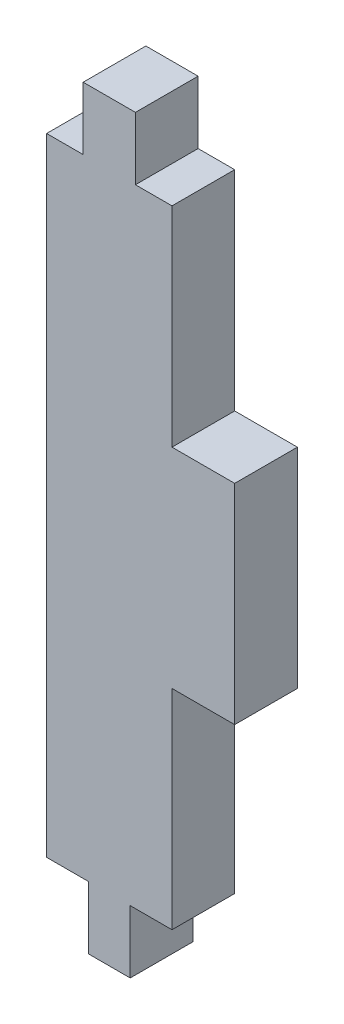
ISO-10303-21;
HEADER;
FILE_DESCRIPTION(('STEP AP214'),'2;1');
FILE_NAME('part.step','',(''),(''),'','','');
FILE_SCHEMA(('AUTOMOTIVE_DESIGN { 1 0 10303 214 1 1 1 1 }'));
ENDSEC;
DATA;
#1=APPLICATION_CONTEXT('core data for automotive mechanical design processes');
#2=APPLICATION_PROTOCOL_DEFINITION('international standard','automotive_design',2000,#1);
#3=PRODUCT_CONTEXT('',#1,'mechanical');
#4=PRODUCT('Part','Part','',(#3));
#5=PRODUCT_RELATED_PRODUCT_CATEGORY('part','',(#4));
#6=PRODUCT_DEFINITION_FORMATION('','',#4);
#7=PRODUCT_DEFINITION_CONTEXT('part definition',#1,'design');
#8=PRODUCT_DEFINITION('design','',#6,#7);
#9=PRODUCT_DEFINITION_SHAPE('','',#8);
#10=(LENGTH_UNIT() NAMED_UNIT(*) SI_UNIT(.MILLI.,.METRE.));
#11=(NAMED_UNIT(*) PLANE_ANGLE_UNIT() SI_UNIT($,.RADIAN.));
#12=(NAMED_UNIT(*) SI_UNIT($,.STERADIAN.) SOLID_ANGLE_UNIT());
#13=UNCERTAINTY_MEASURE_WITH_UNIT(LENGTH_MEASURE(1.E-05),#10,'distance_accuracy_value','');
#14=(GEOMETRIC_REPRESENTATION_CONTEXT(3) GLOBAL_UNCERTAINTY_ASSIGNED_CONTEXT((#13)) GLOBAL_UNIT_ASSIGNED_CONTEXT((#10,
#11,#12)) REPRESENTATION_CONTEXT('',''));
#15=CARTESIAN_POINT('',(0.,0.,0.));
#16=DIRECTION('',(0.,0.,1.));
#17=DIRECTION('',(1.,0.,0.));
#18=AXIS2_PLACEMENT_3D('',#15,#16,#17);
#19=CARTESIAN_POINT('',(-37.2306097479879,-66.1800034107966,0.));
#20=DIRECTION('',(0.,0.,1.));
#21=DIRECTION('',(1.,0.,0.));
#22=AXIS2_PLACEMENT_3D('',#19,#20,#21);
#23=PLANE('',#22);
#24=DIRECTION('',(1.,0.,0.));
#25=VECTOR('',#24,1.);
#26=CARTESIAN_POINT('',(-37.2306097479879,-66.1800034107966,0.));
#27=LINE('',#26,#25);
#28=CARTESIAN_POINT('',(-30.5639430813212,-66.1800034107966,0.));
#29=VERTEX_POINT('',#28);
#30=CARTESIAN_POINT('',(-27.2306097479879,-66.1800034107966,0.));
#31=VERTEX_POINT('',#30);
#32=EDGE_CURVE('E225',#29,#31,#27,.T.);
#33=ORIENTED_EDGE('',*,*,#32,.F.);
#34=DIRECTION('',(0.,-1.,0.));
#35=VECTOR('',#34,1.);
#36=CARTESIAN_POINT('',(-30.5639430813212,-61.1800034107967,0.));
#37=LINE('',#36,#35);
#38=CARTESIAN_POINT('',(-30.5639430813212,-71.1800034107967,0.));
#39=VERTEX_POINT('',#38);
#40=EDGE_CURVE('E307',#29,#39,#37,.T.);
#41=ORIENTED_EDGE('',*,*,#40,.T.);
#42=DIRECTION('',(1.,0.,0.));
#43=VECTOR('',#42,1.);
#44=CARTESIAN_POINT('',(-33.8972764146545,-71.1800034107967,0.));
#45=LINE('',#44,#43);
#46=CARTESIAN_POINT('',(-33.8972764146545,-71.1800034107967,0.));
#47=VERTEX_POINT('',#46);
#48=EDGE_CURVE('E309',#47,#39,#45,.T.);
#49=ORIENTED_EDGE('',*,*,#48,.F.);
#50=DIRECTION('',(0.,-1.,0.));
#51=VECTOR('',#50,1.);
#52=CARTESIAN_POINT('',(-33.8972764146545,-61.1800034107967,0.));
#53=LINE('',#52,#51);
#54=CARTESIAN_POINT('',(-33.8972764146545,-66.1800034107966,0.));
#55=VERTEX_POINT('',#54);
#56=EDGE_CURVE('E302',#55,#47,#53,.T.);
#57=ORIENTED_EDGE('',*,*,#56,.F.);
#58=CARTESIAN_POINT('',(-37.2306097479879,-66.1800034107966,0.));
#59=VERTEX_POINT('',#58);
#60=EDGE_CURVE('E220',#59,#55,#27,.T.);
#61=ORIENTED_EDGE('',*,*,#60,.F.);
#62=DIRECTION('',(0.,-1.,0.));
#63=VECTOR('',#62,1.);
#64=CARTESIAN_POINT('',(-37.2306097479879,-16.1800034107966,0.));
#65=LINE('',#64,#63);
#66=CARTESIAN_POINT('',(-37.2306097479879,-16.1800034107966,0.));
#67=VERTEX_POINT('',#66);
#68=EDGE_CURVE('E297',#67,#59,#65,.T.);
#69=ORIENTED_EDGE('',*,*,#68,.F.);
#70=DIRECTION('',(1.,0.,0.));
#71=VECTOR('',#70,1.);
#72=CARTESIAN_POINT('',(-37.2306097479879,-16.1800034107966,0.));
#73=LINE('',#72,#71);
#74=CARTESIAN_POINT('',(-34.3139430813212,-16.1800034107966,0.));
#75=VERTEX_POINT('',#74);
#76=EDGE_CURVE('E236',#67,#75,#73,.T.);
#77=ORIENTED_EDGE('',*,*,#76,.T.);
#78=DIRECTION('',(0.,-1.,0.));
#79=VECTOR('',#78,1.);
#80=CARTESIAN_POINT('',(-34.3139430813212,-11.1800034107966,0.));
#81=LINE('',#80,#79);
#82=CARTESIAN_POINT('',(-34.3139430813212,-11.1800034107966,0.));
#83=VERTEX_POINT('',#82);
#84=EDGE_CURVE('E281',#83,#75,#81,.T.);
#85=ORIENTED_EDGE('',*,*,#84,.F.);
#86=DIRECTION('',(1.,0.,0.));
#87=VECTOR('',#86,1.);
#88=CARTESIAN_POINT('',(-34.3139430813212,-11.1800034107966,0.));
#89=LINE('',#88,#87);
#90=CARTESIAN_POINT('',(-30.1472764146545,-11.1800034107966,0.));
#91=VERTEX_POINT('',#90);
#92=EDGE_CURVE('E287',#83,#91,#89,.T.);
#93=ORIENTED_EDGE('',*,*,#92,.T.);
#94=DIRECTION('',(0.,-1.,0.));
#95=VECTOR('',#94,1.);
#96=CARTESIAN_POINT('',(-30.1472764146545,-11.1800034107966,0.));
#97=LINE('',#96,#95);
#98=CARTESIAN_POINT('',(-30.1472764146545,-16.1800034107966,0.));
#99=VERTEX_POINT('',#98);
#100=EDGE_CURVE('E290',#91,#99,#97,.T.);
#101=ORIENTED_EDGE('',*,*,#100,.T.);
#102=CARTESIAN_POINT('',(-27.2306097479879,-16.1800034107966,0.));
#103=VERTEX_POINT('',#102);
#104=EDGE_CURVE('E222',#99,#103,#73,.T.);
#105=ORIENTED_EDGE('',*,*,#104,.T.);
#106=DIRECTION('',(0.,-1.,0.));
#107=VECTOR('',#106,1.);
#108=CARTESIAN_POINT('',(-27.2306097479879,-16.1800034107966,0.));
#109=LINE('',#108,#107);
#110=CARTESIAN_POINT('',(-27.2306097479879,-32.8466700774633,0.));
#111=VERTEX_POINT('',#110);
#112=EDGE_CURVE('E191',#103,#111,#109,.T.);
#113=ORIENTED_EDGE('',*,*,#112,.T.);
#114=DIRECTION('',(1.,0.,0.));
#115=VECTOR('',#114,1.);
#116=CARTESIAN_POINT('',(-27.2306097479879,-32.8466700774633,0.));
#117=LINE('',#116,#115);
#118=CARTESIAN_POINT('',(-22.2306097479879,-32.8466700774633,0.));
#119=VERTEX_POINT('',#118);
#120=EDGE_CURVE('E176',#111,#119,#117,.T.);
#121=ORIENTED_EDGE('',*,*,#120,.T.);
#122=DIRECTION('',(0.,1.,0.));
#123=VECTOR('',#122,1.);
#124=CARTESIAN_POINT('',(-22.2306097479879,-49.51333674413,0.));
#125=LINE('',#124,#123);
#126=CARTESIAN_POINT('',(-22.2306097479879,-49.51333674413,0.));
#127=VERTEX_POINT('',#126);
#128=EDGE_CURVE('E165',#127,#119,#125,.T.);
#129=ORIENTED_EDGE('',*,*,#128,.F.);
#130=DIRECTION('',(1.,0.,0.));
#131=VECTOR('',#130,1.);
#132=CARTESIAN_POINT('',(-27.2306097479879,-49.51333674413,0.));
#133=LINE('',#132,#131);
#134=CARTESIAN_POINT('',(-27.2306097479879,-49.51333674413,0.));
#135=VERTEX_POINT('',#134);
#136=EDGE_CURVE('E186',#135,#127,#133,.T.);
#137=ORIENTED_EDGE('',*,*,#136,.F.);
#138=EDGE_CURVE('E211',#135,#31,#109,.T.);
#139=ORIENTED_EDGE('',*,*,#138,.T.);
#140=EDGE_LOOP('',(#33,#41,#49,#57,#61,#69,#77,#85,#93,#101,#105,#113,#121,#129,#137,#139));
#141=FACE_BOUND('',#140,.T.);
#142=ADVANCED_FACE('F103',(#141),#23,.F.);
#143=CARTESIAN_POINT('',(-37.2306097479879,-66.1800034107966,5.));
#144=DIRECTION('',(0.,0.,1.));
#145=DIRECTION('',(1.,0.,0.));
#146=AXIS2_PLACEMENT_3D('',#143,#144,#145);
#147=PLANE('',#146);
#148=DIRECTION('',(1.,0.,0.));
#149=VECTOR('',#148,1.);
#150=CARTESIAN_POINT('',(-37.2306097479879,-66.1800034107966,5.));
#151=LINE('',#150,#149);
#152=CARTESIAN_POINT('',(-37.2306097479879,-66.1800034107966,5.));
#153=VERTEX_POINT('',#152);
#154=CARTESIAN_POINT('',(-33.8972764146545,-66.1800034107966,5.));
#155=VERTEX_POINT('',#154);
#156=EDGE_CURVE('E340',#153,#155,#151,.T.);
#157=ORIENTED_EDGE('',*,*,#156,.T.);
#158=DIRECTION('',(0.,-1.,0.));
#159=VECTOR('',#158,1.);
#160=CARTESIAN_POINT('',(-33.8972764146545,-61.1800034107967,5.));
#161=LINE('',#160,#159);
#162=CARTESIAN_POINT('',(-33.8972764146545,-71.1800034107967,5.));
#163=VERTEX_POINT('',#162);
#164=EDGE_CURVE('E305',#155,#163,#161,.T.);
#165=ORIENTED_EDGE('',*,*,#164,.T.);
#166=DIRECTION('',(1.,0.,0.));
#167=VECTOR('',#166,1.);
#168=CARTESIAN_POINT('',(-33.8972764146545,-71.1800034107967,5.));
#169=LINE('',#168,#167);
#170=CARTESIAN_POINT('',(-30.5639430813212,-71.1800034107967,5.));
#171=VERTEX_POINT('',#170);
#172=EDGE_CURVE('E301',#163,#171,#169,.T.);
#173=ORIENTED_EDGE('',*,*,#172,.T.);
#174=DIRECTION('',(0.,-1.,0.));
#175=VECTOR('',#174,1.);
#176=CARTESIAN_POINT('',(-30.5639430813212,-61.1800034107967,5.));
#177=LINE('',#176,#175);
#178=CARTESIAN_POINT('',(-30.5639430813212,-66.1800034107966,5.));
#179=VERTEX_POINT('',#178);
#180=EDGE_CURVE('E299',#179,#171,#177,.T.);
#181=ORIENTED_EDGE('',*,*,#180,.F.);
#182=CARTESIAN_POINT('',(-27.2306097479879,-66.1800034107966,5.));
#183=VERTEX_POINT('',#182);
#184=EDGE_CURVE('E349',#179,#183,#151,.T.);
#185=ORIENTED_EDGE('',*,*,#184,.T.);
#186=DIRECTION('',(0.,-1.,0.));
#187=VECTOR('',#186,1.);
#188=CARTESIAN_POINT('',(-27.2306097479879,-16.1800034107966,5.));
#189=LINE('',#188,#187);
#190=CARTESIAN_POINT('',(-27.2306097479879,-49.51333674413,5.));
#191=VERTEX_POINT('',#190);
#192=EDGE_CURVE('E343',#191,#183,#189,.T.);
#193=ORIENTED_EDGE('',*,*,#192,.F.);
#194=DIRECTION('',(1.,0.,0.));
#195=VECTOR('',#194,1.);
#196=CARTESIAN_POINT('',(-27.2306097479879,-49.51333674413,5.));
#197=LINE('',#196,#195);
#198=CARTESIAN_POINT('',(-22.2306097479879,-49.51333674413,5.));
#199=VERTEX_POINT('',#198);
#200=EDGE_CURVE('E192',#191,#199,#197,.T.);
#201=ORIENTED_EDGE('',*,*,#200,.T.);
#202=DIRECTION('',(0.,1.,0.));
#203=VECTOR('',#202,1.);
#204=CARTESIAN_POINT('',(-22.2306097479879,-49.51333674413,5.));
#205=LINE('',#204,#203);
#206=CARTESIAN_POINT('',(-22.2306097479879,-32.8466700774633,5.));
#207=VERTEX_POINT('',#206);
#208=EDGE_CURVE('E195',#199,#207,#205,.T.);
#209=ORIENTED_EDGE('',*,*,#208,.T.);
#210=DIRECTION('',(1.,0.,0.));
#211=VECTOR('',#210,1.);
#212=CARTESIAN_POINT('',(-27.2306097479879,-32.8466700774633,5.));
#213=LINE('',#212,#211);
#214=CARTESIAN_POINT('',(-27.2306097479879,-32.8466700774633,5.));
#215=VERTEX_POINT('',#214);
#216=EDGE_CURVE('E179',#215,#207,#213,.T.);
#217=ORIENTED_EDGE('',*,*,#216,.F.);
#218=CARTESIAN_POINT('',(-27.2306097479879,-16.1800034107966,5.));
#219=VERTEX_POINT('',#218);
#220=EDGE_CURVE('E230',#219,#215,#189,.T.);
#221=ORIENTED_EDGE('',*,*,#220,.F.);
#222=DIRECTION('',(1.,0.,0.));
#223=VECTOR('',#222,1.);
#224=CARTESIAN_POINT('',(-37.2306097479879,-16.1800034107966,5.));
#225=LINE('',#224,#223);
#226=CARTESIAN_POINT('',(-30.1472764146545,-16.1800034107966,5.));
#227=VERTEX_POINT('',#226);
#228=EDGE_CURVE('E337',#227,#219,#225,.T.);
#229=ORIENTED_EDGE('',*,*,#228,.F.);
#230=DIRECTION('',(0.,-1.,0.));
#231=VECTOR('',#230,1.);
#232=CARTESIAN_POINT('',(-30.1472764146545,-11.1800034107966,5.));
#233=LINE('',#232,#231);
#234=CARTESIAN_POINT('',(-30.1472764146545,-11.1800034107966,5.));
#235=VERTEX_POINT('',#234);
#236=EDGE_CURVE('E280',#235,#227,#233,.T.);
#237=ORIENTED_EDGE('',*,*,#236,.F.);
#238=DIRECTION('',(1.,0.,0.));
#239=VECTOR('',#238,1.);
#240=CARTESIAN_POINT('',(-34.3139430813212,-11.1800034107966,5.));
#241=LINE('',#240,#239);
#242=CARTESIAN_POINT('',(-34.3139430813212,-11.1800034107966,5.));
#243=VERTEX_POINT('',#242);
#244=EDGE_CURVE('E277',#243,#235,#241,.T.);
#245=ORIENTED_EDGE('',*,*,#244,.F.);
#246=DIRECTION('',(0.,-1.,0.));
#247=VECTOR('',#246,1.);
#248=CARTESIAN_POINT('',(-34.3139430813212,-11.1800034107966,5.));
#249=LINE('',#248,#247);
#250=CARTESIAN_POINT('',(-34.3139430813212,-16.1800034107966,5.));
#251=VERTEX_POINT('',#250);
#252=EDGE_CURVE('E283',#243,#251,#249,.T.);
#253=ORIENTED_EDGE('',*,*,#252,.T.);
#254=CARTESIAN_POINT('',(-37.2306097479879,-16.1800034107966,5.));
#255=VERTEX_POINT('',#254);
#256=EDGE_CURVE('E245',#255,#251,#225,.T.);
#257=ORIENTED_EDGE('',*,*,#256,.F.);
#258=DIRECTION('',(0.,-1.,0.));
#259=VECTOR('',#258,1.);
#260=CARTESIAN_POINT('',(-37.2306097479879,-16.1800034107966,5.));
#261=LINE('',#260,#259);
#262=EDGE_CURVE('E240',#255,#153,#261,.T.);
#263=ORIENTED_EDGE('',*,*,#262,.T.);
#264=EDGE_LOOP('',(#157,#165,#173,#181,#185,#193,#201,#209,#217,#221,#229,#237,#245,#253,#257,#263));
#265=FACE_BOUND('',#264,.T.);
#266=ADVANCED_FACE('F355',(#265),#147,.T.);
#267=CARTESIAN_POINT('',(-37.2306097479879,-16.1800034107966,5.));
#268=DIRECTION('',(0.,1.,0.));
#269=DIRECTION('',(0.,0.,1.));
#270=AXIS2_PLACEMENT_3D('',#267,#268,#269);
#271=PLANE('',#270);
#272=ORIENTED_EDGE('',*,*,#256,.T.);
#273=DIRECTION('',(0.,0.,-1.));
#274=VECTOR('',#273,1.);
#275=CARTESIAN_POINT('',(-34.3139430813212,-16.1800034107966,5.));
#276=LINE('',#275,#274);
#277=EDGE_CURVE('E254',#251,#75,#276,.T.);
#278=ORIENTED_EDGE('',*,*,#277,.T.);
#279=ORIENTED_EDGE('',*,*,#76,.F.);
#280=DIRECTION('',(0.,0.,-1.));
#281=VECTOR('',#280,1.);
#282=CARTESIAN_POINT('',(-37.2306097479879,-16.1800034107966,5.));
#283=LINE('',#282,#281);
#284=EDGE_CURVE('E241',#255,#67,#283,.T.);
#285=ORIENTED_EDGE('',*,*,#284,.F.);
#286=EDGE_LOOP('',(#272,#278,#279,#285));
#287=FACE_BOUND('',#286,.T.);
#288=ADVANCED_FACE('F362',(#287),#271,.T.);
#289=CARTESIAN_POINT('',(-37.2306097479879,-16.1800034107966,5.));
#290=DIRECTION('',(1.,0.,0.));
#291=DIRECTION('',(0.,1.,0.));
#292=AXIS2_PLACEMENT_3D('',#289,#290,#291);
#293=PLANE('',#292);
#294=ORIENTED_EDGE('',*,*,#68,.T.);
#295=DIRECTION('',(0.,0.,-1.));
#296=VECTOR('',#295,1.);
#297=CARTESIAN_POINT('',(-37.2306097479879,-66.1800034107966,5.));
#298=LINE('',#297,#296);
#299=EDGE_CURVE('E248',#153,#59,#298,.T.);
#300=ORIENTED_EDGE('',*,*,#299,.F.);
#301=ORIENTED_EDGE('',*,*,#262,.F.);
#302=ORIENTED_EDGE('',*,*,#284,.T.);
#303=EDGE_LOOP('',(#294,#300,#301,#302));
#304=FACE_BOUND('',#303,.T.);
#305=ADVANCED_FACE('F359',(#304),#293,.F.);
#306=CARTESIAN_POINT('',(-37.2306097479879,-66.1800034107966,5.));
#307=DIRECTION('',(0.,1.,0.));
#308=DIRECTION('',(0.,0.,1.));
#309=AXIS2_PLACEMENT_3D('',#306,#307,#308);
#310=PLANE('',#309);
#311=DIRECTION('',(0.,0.,-1.));
#312=VECTOR('',#311,1.);
#313=CARTESIAN_POINT('',(-33.8972764146545,-66.1800034107966,5.));
#314=LINE('',#313,#312);
#315=EDGE_CURVE('E264',#155,#55,#314,.T.);
#316=ORIENTED_EDGE('',*,*,#315,.F.);
#317=ORIENTED_EDGE('',*,*,#156,.F.);
#318=ORIENTED_EDGE('',*,*,#299,.T.);
#319=ORIENTED_EDGE('',*,*,#60,.T.);
#320=EDGE_LOOP('',(#316,#317,#318,#319));
#321=FACE_BOUND('',#320,.T.);
#322=ADVANCED_FACE('F361',(#321),#310,.F.);
#323=ORIENTED_EDGE('',*,*,#184,.F.);
#324=DIRECTION('',(0.,0.,-1.));
#325=VECTOR('',#324,1.);
#326=CARTESIAN_POINT('',(-30.5639430813212,-66.1800034107966,5.));
#327=LINE('',#326,#325);
#328=EDGE_CURVE('E261',#179,#29,#327,.T.);
#329=ORIENTED_EDGE('',*,*,#328,.T.);
#330=ORIENTED_EDGE('',*,*,#32,.T.);
#331=DIRECTION('',(0.,0.,-1.));
#332=VECTOR('',#331,1.);
#333=CARTESIAN_POINT('',(-27.2306097479879,-66.1800034107966,5.));
#334=LINE('',#333,#332);
#335=EDGE_CURVE('E219',#183,#31,#334,.T.);
#336=ORIENTED_EDGE('',*,*,#335,.F.);
#337=EDGE_LOOP('',(#323,#329,#330,#336));
#338=FACE_BOUND('',#337,.T.);
#339=ADVANCED_FACE('F368',(#338),#310,.F.);
#340=CARTESIAN_POINT('',(-27.2306097479879,-16.1800034107966,5.));
#341=DIRECTION('',(1.,0.,0.));
#342=DIRECTION('',(0.,1.,0.));
#343=AXIS2_PLACEMENT_3D('',#340,#341,#342);
#344=PLANE('',#343);
#345=DIRECTION('',(0.,0.,-1.));
#346=VECTOR('',#345,1.);
#347=CARTESIAN_POINT('',(-27.2306097479879,-49.51333674413,5.));
#348=LINE('',#347,#346);
#349=EDGE_CURVE('E12',#191,#135,#348,.T.);
#350=ORIENTED_EDGE('',*,*,#349,.F.);
#351=ORIENTED_EDGE('',*,*,#192,.T.);
#352=ORIENTED_EDGE('',*,*,#335,.T.);
#353=ORIENTED_EDGE('',*,*,#138,.F.);
#354=EDGE_LOOP('',(#350,#351,#352,#353));
#355=FACE_BOUND('',#354,.T.);
#356=ADVANCED_FACE('F216',(#355),#344,.T.);
#357=ORIENTED_EDGE('',*,*,#220,.T.);
#358=DIRECTION('',(0.,0.,-1.));
#359=VECTOR('',#358,1.);
#360=CARTESIAN_POINT('',(-27.2306097479879,-32.8466700774633,5.));
#361=LINE('',#360,#359);
#362=EDGE_CURVE('E113',#215,#111,#361,.T.);
#363=ORIENTED_EDGE('',*,*,#362,.T.);
#364=ORIENTED_EDGE('',*,*,#112,.F.);
#365=DIRECTION('',(0.,0.,-1.));
#366=VECTOR('',#365,1.);
#367=CARTESIAN_POINT('',(-27.2306097479879,-16.1800034107966,5.));
#368=LINE('',#367,#366);
#369=EDGE_CURVE('E244',#219,#103,#368,.T.);
#370=ORIENTED_EDGE('',*,*,#369,.F.);
#371=EDGE_LOOP('',(#357,#363,#364,#370));
#372=FACE_BOUND('',#371,.T.);
#373=ADVANCED_FACE('F408',(#372),#344,.T.);
#374=DIRECTION('',(0.,0.,-1.));
#375=VECTOR('',#374,1.);
#376=CARTESIAN_POINT('',(-30.1472764146545,-16.1800034107966,5.));
#377=LINE('',#376,#375);
#378=EDGE_CURVE('E122',#227,#99,#377,.T.);
#379=ORIENTED_EDGE('',*,*,#378,.F.);
#380=ORIENTED_EDGE('',*,*,#228,.T.);
#381=ORIENTED_EDGE('',*,*,#369,.T.);
#382=ORIENTED_EDGE('',*,*,#104,.F.);
#383=EDGE_LOOP('',(#379,#380,#381,#382));
#384=FACE_BOUND('',#383,.T.);
#385=ADVANCED_FACE('F372',(#384),#271,.T.);
#386=CARTESIAN_POINT('',(-33.8972764146545,-71.1800034107967,5.));
#387=DIRECTION('',(0.,1.,0.));
#388=DIRECTION('',(0.,0.,1.));
#389=AXIS2_PLACEMENT_3D('',#386,#387,#388);
#390=PLANE('',#389);
#391=ORIENTED_EDGE('',*,*,#48,.T.);
#392=DIRECTION('',(0.,0.,-1.));
#393=VECTOR('',#392,1.);
#394=CARTESIAN_POINT('',(-30.5639430813212,-71.1800034107967,5.));
#395=LINE('',#394,#393);
#396=EDGE_CURVE('E269',#171,#39,#395,.T.);
#397=ORIENTED_EDGE('',*,*,#396,.F.);
#398=ORIENTED_EDGE('',*,*,#172,.F.);
#399=DIRECTION('',(0.,0.,-1.));
#400=VECTOR('',#399,1.);
#401=CARTESIAN_POINT('',(-33.8972764146545,-71.1800034107967,5.));
#402=LINE('',#401,#400);
#403=EDGE_CURVE('E291',#163,#47,#402,.T.);
#404=ORIENTED_EDGE('',*,*,#403,.T.);
#405=EDGE_LOOP('',(#391,#397,#398,#404));
#406=FACE_BOUND('',#405,.T.);
#407=ADVANCED_FACE('F325',(#406),#390,.F.);
#408=CARTESIAN_POINT('',(-30.5639430813212,-61.1800034107967,5.));
#409=DIRECTION('',(1.,0.,0.));
#410=DIRECTION('',(0.,0.,-1.));
#411=AXIS2_PLACEMENT_3D('',#408,#409,#410);
#412=PLANE('',#411);
#413=ORIENTED_EDGE('',*,*,#328,.F.);
#414=ORIENTED_EDGE('',*,*,#180,.T.);
#415=ORIENTED_EDGE('',*,*,#396,.T.);
#416=ORIENTED_EDGE('',*,*,#40,.F.);
#417=EDGE_LOOP('',(#413,#414,#415,#416));
#418=FACE_BOUND('',#417,.T.);
#419=ADVANCED_FACE('F322',(#418),#412,.T.);
#420=CARTESIAN_POINT('',(-33.8972764146545,-61.1800034107967,5.));
#421=DIRECTION('',(1.,0.,0.));
#422=DIRECTION('',(0.,0.,-1.));
#423=AXIS2_PLACEMENT_3D('',#420,#421,#422);
#424=PLANE('',#423);
#425=ORIENTED_EDGE('',*,*,#164,.F.);
#426=ORIENTED_EDGE('',*,*,#315,.T.);
#427=ORIENTED_EDGE('',*,*,#56,.T.);
#428=ORIENTED_EDGE('',*,*,#403,.F.);
#429=EDGE_LOOP('',(#425,#426,#427,#428));
#430=FACE_BOUND('',#429,.T.);
#431=ADVANCED_FACE('F386',(#430),#424,.F.);
#432=CARTESIAN_POINT('',(-22.2306097479879,-49.51333674413,5.));
#433=DIRECTION('',(-1.,0.,0.));
#434=DIRECTION('',(0.,0.,1.));
#435=AXIS2_PLACEMENT_3D('',#432,#433,#434);
#436=PLANE('',#435);
#437=ORIENTED_EDGE('',*,*,#128,.T.);
#438=DIRECTION('',(0.,0.,-1.));
#439=VECTOR('',#438,1.);
#440=CARTESIAN_POINT('',(-22.2306097479879,-32.8466700774633,5.));
#441=LINE('',#440,#439);
#442=EDGE_CURVE('E172',#207,#119,#441,.T.);
#443=ORIENTED_EDGE('',*,*,#442,.F.);
#444=ORIENTED_EDGE('',*,*,#208,.F.);
#445=DIRECTION('',(0.,0.,-1.));
#446=VECTOR('',#445,1.);
#447=CARTESIAN_POINT('',(-22.2306097479879,-49.51333674413,5.));
#448=LINE('',#447,#446);
#449=EDGE_CURVE('E181',#199,#127,#448,.T.);
#450=ORIENTED_EDGE('',*,*,#449,.T.);
#451=EDGE_LOOP('',(#437,#443,#444,#450));
#452=FACE_BOUND('',#451,.T.);
#453=ADVANCED_FACE('F183',(#452),#436,.F.);
#454=CARTESIAN_POINT('',(-27.2306097479879,-32.8466700774633,5.));
#455=DIRECTION('',(0.,1.,0.));
#456=DIRECTION('',(0.,0.,1.));
#457=AXIS2_PLACEMENT_3D('',#454,#455,#456);
#458=PLANE('',#457);
#459=ORIENTED_EDGE('',*,*,#120,.F.);
#460=ORIENTED_EDGE('',*,*,#362,.F.);
#461=ORIENTED_EDGE('',*,*,#216,.T.);
#462=ORIENTED_EDGE('',*,*,#442,.T.);
#463=EDGE_LOOP('',(#459,#460,#461,#462));
#464=FACE_BOUND('',#463,.T.);
#465=ADVANCED_FACE('F173',(#464),#458,.T.);
#466=CARTESIAN_POINT('',(-27.2306097479879,-49.51333674413,5.));
#467=DIRECTION('',(0.,1.,0.));
#468=DIRECTION('',(0.,0.,1.));
#469=AXIS2_PLACEMENT_3D('',#466,#467,#468);
#470=PLANE('',#469);
#471=ORIENTED_EDGE('',*,*,#136,.T.);
#472=ORIENTED_EDGE('',*,*,#449,.F.);
#473=ORIENTED_EDGE('',*,*,#200,.F.);
#474=ORIENTED_EDGE('',*,*,#349,.T.);
#475=EDGE_LOOP('',(#471,#472,#473,#474));
#476=FACE_BOUND('',#475,.T.);
#477=ADVANCED_FACE('F105',(#476),#470,.F.);
#478=CARTESIAN_POINT('',(-30.1472764146545,-11.1800034107966,5.));
#479=DIRECTION('',(1.,0.,0.));
#480=DIRECTION('',(0.,0.,-1.));
#481=AXIS2_PLACEMENT_3D('',#478,#479,#480);
#482=PLANE('',#481);
#483=ORIENTED_EDGE('',*,*,#236,.T.);
#484=ORIENTED_EDGE('',*,*,#378,.T.);
#485=ORIENTED_EDGE('',*,*,#100,.F.);
#486=DIRECTION('',(0.,0.,-1.));
#487=VECTOR('',#486,1.);
#488=CARTESIAN_POINT('',(-30.1472764146545,-11.1800034107966,5.));
#489=LINE('',#488,#487);
#490=EDGE_CURVE('E286',#235,#91,#489,.T.);
#491=ORIENTED_EDGE('',*,*,#490,.F.);
#492=EDGE_LOOP('',(#483,#484,#485,#491));
#493=FACE_BOUND('',#492,.T.);
#494=ADVANCED_FACE('F380',(#493),#482,.T.);
#495=CARTESIAN_POINT('',(-34.3139430813212,-11.1800034107966,5.));
#496=DIRECTION('',(0.,1.,0.));
#497=DIRECTION('',(0.,0.,1.));
#498=AXIS2_PLACEMENT_3D('',#495,#496,#497);
#499=PLANE('',#498);
#500=ORIENTED_EDGE('',*,*,#92,.F.);
#501=DIRECTION('',(0.,0.,-1.));
#502=VECTOR('',#501,1.);
#503=CARTESIAN_POINT('',(-34.3139430813212,-11.1800034107966,5.));
#504=LINE('',#503,#502);
#505=EDGE_CURVE('E295',#243,#83,#504,.T.);
#506=ORIENTED_EDGE('',*,*,#505,.F.);
#507=ORIENTED_EDGE('',*,*,#244,.T.);
#508=ORIENTED_EDGE('',*,*,#490,.T.);
#509=EDGE_LOOP('',(#500,#506,#507,#508));
#510=FACE_BOUND('',#509,.T.);
#511=ADVANCED_FACE('F378',(#510),#499,.T.);
#512=CARTESIAN_POINT('',(-34.3139430813212,-11.1800034107966,5.));
#513=DIRECTION('',(1.,0.,0.));
#514=DIRECTION('',(0.,0.,-1.));
#515=AXIS2_PLACEMENT_3D('',#512,#513,#514);
#516=PLANE('',#515);
#517=ORIENTED_EDGE('',*,*,#277,.F.);
#518=ORIENTED_EDGE('',*,*,#252,.F.);
#519=ORIENTED_EDGE('',*,*,#505,.T.);
#520=ORIENTED_EDGE('',*,*,#84,.T.);
#521=EDGE_LOOP('',(#517,#518,#519,#520));
#522=FACE_BOUND('',#521,.T.);
#523=ADVANCED_FACE('F375',(#522),#516,.F.);
#524=CLOSED_SHELL('',(#142,#266,#288,#305,#322,#339,#356,#373,#385,#407,#419,#431,#453,#465,
#477,#494,#511,#523));
#525=MANIFOLD_SOLID_BREP('B2',#524);
#526=ADVANCED_BREP_SHAPE_REPRESENTATION('',(#18,#525),#14);
#527=SHAPE_DEFINITION_REPRESENTATION(#9,#526);
ENDSEC;
END-ISO-10303-21;
